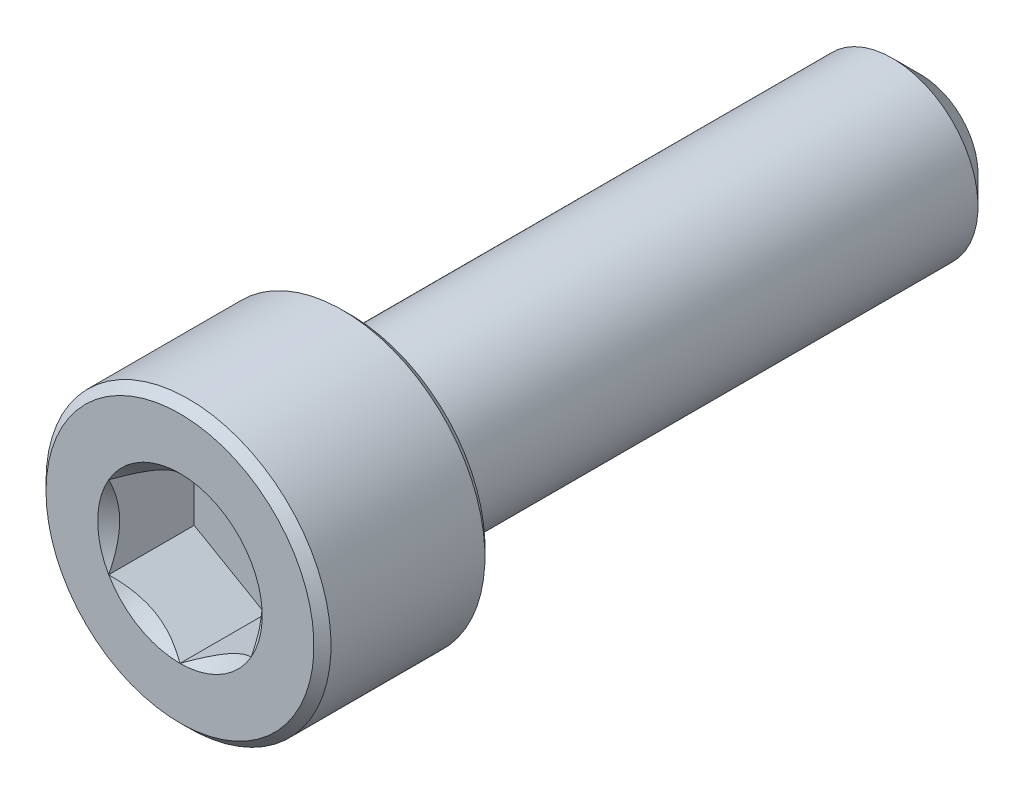
ISO-10303-21;
HEADER;
FILE_DESCRIPTION(('STEP AP214'),'2;1');
FILE_NAME('part.step','',(''),(''),'','','');
FILE_SCHEMA(('AUTOMOTIVE_DESIGN { 1 0 10303 214 1 1 1 1 }'));
ENDSEC;
DATA;
#1=APPLICATION_CONTEXT('core data for automotive mechanical design processes');
#2=APPLICATION_PROTOCOL_DEFINITION('international standard','automotive_design',2000,#1);
#3=PRODUCT_CONTEXT('',#1,'mechanical');
#4=PRODUCT('Part','Part','',(#3));
#5=PRODUCT_RELATED_PRODUCT_CATEGORY('part','',(#4));
#6=PRODUCT_DEFINITION_FORMATION('','',#4);
#7=PRODUCT_DEFINITION_CONTEXT('part definition',#1,'design');
#8=PRODUCT_DEFINITION('design','',#6,#7);
#9=PRODUCT_DEFINITION_SHAPE('','',#8);
#10=(LENGTH_UNIT() NAMED_UNIT(*) SI_UNIT(.MILLI.,.METRE.));
#11=(NAMED_UNIT(*) PLANE_ANGLE_UNIT() SI_UNIT($,.RADIAN.));
#12=(NAMED_UNIT(*) SI_UNIT($,.STERADIAN.) SOLID_ANGLE_UNIT());
#13=UNCERTAINTY_MEASURE_WITH_UNIT(LENGTH_MEASURE(1.E-05),#10,'distance_accuracy_value','');
#14=(GEOMETRIC_REPRESENTATION_CONTEXT(3) GLOBAL_UNCERTAINTY_ASSIGNED_CONTEXT((#13)) GLOBAL_UNIT_ASSIGNED_CONTEXT((#10,
#11,#12)) REPRESENTATION_CONTEXT('',''));
#15=CARTESIAN_POINT('',(0.,0.,0.));
#16=DIRECTION('',(0.,0.,1.));
#17=DIRECTION('',(1.,0.,0.));
#18=AXIS2_PLACEMENT_3D('',#15,#16,#17);
#19=CARTESIAN_POINT('',(0.,4.7,13.));
#20=DIRECTION('',(0.,0.,1.));
#21=DIRECTION('',(1.,0.,0.));
#22=AXIS2_PLACEMENT_3D('',#19,#20,#21);
#23=PLANE('',#22);
#24=CARTESIAN_POINT('',(0.,0.,13.));
#25=DIRECTION('',(0.,0.,1.));
#26=DIRECTION('',(1.,0.,0.));
#27=AXIS2_PLACEMENT_3D('',#24,#25,#26);
#28=CIRCLE('',#27,2.88675134594813);
#29=CARTESIAN_POINT('',(2.5,1.44337567297407,13.));
#30=VERTEX_POINT('',#29);
#31=CARTESIAN_POINT('',(0.,2.88675134594813,13.));
#32=VERTEX_POINT('',#31);
#33=EDGE_CURVE('E92',#30,#32,#28,.T.);
#34=ORIENTED_EDGE('',*,*,#33,.F.);
#35=CARTESIAN_POINT('',(2.5,-1.44337567297407,13.));
#36=VERTEX_POINT('',#35);
#37=EDGE_CURVE('E52',#36,#30,#28,.T.);
#38=ORIENTED_EDGE('',*,*,#37,.F.);
#39=CARTESIAN_POINT('',(0.,-2.88675134594813,13.));
#40=VERTEX_POINT('',#39);
#41=EDGE_CURVE('E278',#40,#36,#28,.T.);
#42=ORIENTED_EDGE('',*,*,#41,.F.);
#43=CARTESIAN_POINT('',(-2.5,-1.44337567297406,13.));
#44=VERTEX_POINT('',#43);
#45=EDGE_CURVE('E59',#44,#40,#28,.T.);
#46=ORIENTED_EDGE('',*,*,#45,.F.);
#47=CARTESIAN_POINT('',(-2.5,1.44337567297407,13.));
#48=VERTEX_POINT('',#47);
#49=EDGE_CURVE('E128',#48,#44,#28,.T.);
#50=ORIENTED_EDGE('',*,*,#49,.F.);
#51=EDGE_CURVE('E101',#32,#48,#28,.T.);
#52=ORIENTED_EDGE('',*,*,#51,.F.);
#53=EDGE_LOOP('',(#34,#38,#42,#46,#50,#52));
#54=FACE_BOUND('',#53,.T.);
#55=CARTESIAN_POINT('',(0.,0.,13.));
#56=DIRECTION('',(0.,0.,-1.));
#57=DIRECTION('',(-1.,0.,0.));
#58=AXIS2_PLACEMENT_3D('',#55,#56,#57);
#59=CIRCLE('',#58,4.7);
#60=CARTESIAN_POINT('',(-4.7,0.,13.));
#61=VERTEX_POINT('',#60);
#62=EDGE_CURVE('E46',#61,#61,#59,.T.);
#63=ORIENTED_EDGE('',*,*,#62,.F.);
#64=EDGE_LOOP('',(#63));
#65=FACE_BOUND('',#64,.T.);
#66=ADVANCED_FACE('F33',(#54,#65),#23,.T.);
#67=CARTESIAN_POINT('',(0.,0.,12.7));
#68=DIRECTION('',(0.,0.,-1.));
#69=DIRECTION('',(-1.,0.,0.));
#70=AXIS2_PLACEMENT_3D('',#67,#68,#69);
#71=CONICAL_SURFACE('',#70,5.,0.785398163397451);
#72=ORIENTED_EDGE('',*,*,#62,.T.);
#73=EDGE_LOOP('',(#72));
#74=FACE_BOUND('',#73,.T.);
#75=CARTESIAN_POINT('',(0.,0.,12.7));
#76=DIRECTION('',(0.,0.,-1.));
#77=DIRECTION('',(-1.,0.,0.));
#78=AXIS2_PLACEMENT_3D('',#75,#76,#77);
#79=CIRCLE('',#78,5.);
#80=CARTESIAN_POINT('',(-5.,0.,12.7));
#81=VERTEX_POINT('',#80);
#82=EDGE_CURVE('E212',#81,#81,#79,.T.);
#83=ORIENTED_EDGE('',*,*,#82,.F.);
#84=EDGE_LOOP('',(#83));
#85=FACE_BOUND('',#84,.T.);
#86=ADVANCED_FACE('F217',(#74,#85),#71,.T.);
#87=CARTESIAN_POINT('',(0.,0.,-13.));
#88=DIRECTION('',(0.,0.,-1.));
#89=DIRECTION('',(-1.,0.,0.));
#90=AXIS2_PLACEMENT_3D('',#87,#88,#89);
#91=CYLINDRICAL_SURFACE('',#90,5.);
#92=ORIENTED_EDGE('',*,*,#82,.T.);
#93=EDGE_LOOP('',(#92));
#94=FACE_BOUND('',#93,.T.);
#95=CARTESIAN_POINT('',(0.,0.,7.3));
#96=DIRECTION('',(0.,0.,-1.));
#97=DIRECTION('',(-1.,0.,0.));
#98=AXIS2_PLACEMENT_3D('',#95,#96,#97);
#99=CIRCLE('',#98,5.);
#100=CARTESIAN_POINT('',(-5.,0.,7.3));
#101=VERTEX_POINT('',#100);
#102=EDGE_CURVE('E209',#101,#101,#99,.T.);
#103=ORIENTED_EDGE('',*,*,#102,.F.);
#104=EDGE_LOOP('',(#103));
#105=FACE_BOUND('',#104,.T.);
#106=ADVANCED_FACE('F223',(#94,#105),#91,.T.);
#107=CARTESIAN_POINT('',(0.,0.,7.));
#108=DIRECTION('',(0.,0.,1.));
#109=DIRECTION('',(1.,0.,0.));
#110=AXIS2_PLACEMENT_3D('',#107,#108,#109);
#111=CONICAL_SURFACE('',#110,4.7,0.78539816339745);
#112=ORIENTED_EDGE('',*,*,#102,.T.);
#113=EDGE_LOOP('',(#112));
#114=FACE_BOUND('',#113,.T.);
#115=CARTESIAN_POINT('',(0.,0.,7.));
#116=DIRECTION('',(0.,0.,-1.));
#117=DIRECTION('',(-1.,0.,0.));
#118=AXIS2_PLACEMENT_3D('',#115,#116,#117);
#119=CIRCLE('',#118,4.7);
#120=CARTESIAN_POINT('',(-4.7,0.,7.));
#121=VERTEX_POINT('',#120);
#122=EDGE_CURVE('E206',#121,#121,#119,.T.);
#123=ORIENTED_EDGE('',*,*,#122,.F.);
#124=EDGE_LOOP('',(#123));
#125=FACE_BOUND('',#124,.T.);
#126=ADVANCED_FACE('F227',(#114,#125),#111,.T.);
#127=CARTESIAN_POINT('',(0.,4.7,7.));
#128=DIRECTION('',(0.,0.,-1.));
#129=DIRECTION('',(-1.,0.,0.));
#130=AXIS2_PLACEMENT_3D('',#127,#128,#129);
#131=PLANE('',#130);
#132=ORIENTED_EDGE('',*,*,#122,.T.);
#133=EDGE_LOOP('',(#132));
#134=FACE_BOUND('',#133,.T.);
#135=CARTESIAN_POINT('',(0.,0.,7.));
#136=DIRECTION('',(0.,0.,-1.));
#137=DIRECTION('',(-1.,0.,0.));
#138=AXIS2_PLACEMENT_3D('',#135,#136,#137);
#139=CIRCLE('',#138,3.);
#140=CARTESIAN_POINT('',(-3.,0.,7.));
#141=VERTEX_POINT('',#140);
#142=EDGE_CURVE('E203',#141,#141,#139,.T.);
#143=ORIENTED_EDGE('',*,*,#142,.F.);
#144=EDGE_LOOP('',(#143));
#145=FACE_BOUND('',#144,.T.);
#146=ADVANCED_FACE('F233',(#134,#145),#131,.T.);
#147=CARTESIAN_POINT('',(0.,0.,-13.));
#148=DIRECTION('',(0.,0.,-1.));
#149=DIRECTION('',(-1.,0.,0.));
#150=AXIS2_PLACEMENT_3D('',#147,#148,#149);
#151=CYLINDRICAL_SURFACE('',#150,3.);
#152=ORIENTED_EDGE('',*,*,#142,.T.);
#153=EDGE_LOOP('',(#152));
#154=FACE_BOUND('',#153,.T.);
#155=CARTESIAN_POINT('',(0.,0.,-12.));
#156=DIRECTION('',(0.,0.,-1.));
#157=DIRECTION('',(-1.,0.,0.));
#158=AXIS2_PLACEMENT_3D('',#155,#156,#157);
#159=CIRCLE('',#158,3.);
#160=CARTESIAN_POINT('',(-3.,0.,-12.));
#161=VERTEX_POINT('',#160);
#162=EDGE_CURVE('E200',#161,#161,#159,.T.);
#163=ORIENTED_EDGE('',*,*,#162,.F.);
#164=EDGE_LOOP('',(#163));
#165=FACE_BOUND('',#164,.T.);
#166=ADVANCED_FACE('F237',(#154,#165),#151,.T.);
#167=CARTESIAN_POINT('',(0.,0.,-13.));
#168=DIRECTION('',(0.,0.,1.));
#169=DIRECTION('',(1.,0.,0.));
#170=AXIS2_PLACEMENT_3D('',#167,#168,#169);
#171=CONICAL_SURFACE('',#170,2.,0.785398163397444);
#172=ORIENTED_EDGE('',*,*,#162,.T.);
#173=EDGE_LOOP('',(#172));
#174=FACE_BOUND('',#173,.T.);
#175=CARTESIAN_POINT('',(0.,0.,-13.));
#176=DIRECTION('',(0.,0.,-1.));
#177=DIRECTION('',(-1.,0.,0.));
#178=AXIS2_PLACEMENT_3D('',#175,#176,#177);
#179=CIRCLE('',#178,2.);
#180=CARTESIAN_POINT('',(-2.,0.,-13.));
#181=VERTEX_POINT('',#180);
#182=EDGE_CURVE('E188',#181,#181,#179,.T.);
#183=ORIENTED_EDGE('',*,*,#182,.F.);
#184=EDGE_LOOP('',(#183));
#185=FACE_BOUND('',#184,.T.);
#186=ADVANCED_FACE('F240',(#174,#185),#171,.T.);
#187=CARTESIAN_POINT('',(0.,2.,-13.));
#188=DIRECTION('',(0.,0.,-1.));
#189=DIRECTION('',(-1.,0.,0.));
#190=AXIS2_PLACEMENT_3D('',#187,#188,#189);
#191=PLANE('',#190);
#192=ORIENTED_EDGE('',*,*,#182,.T.);
#193=EDGE_LOOP('',(#192));
#194=FACE_BOUND('',#193,.T.);
#195=ADVANCED_FACE('F161',(#194),#191,.T.);
#196=CARTESIAN_POINT('',(0.,0.,13.));
#197=DIRECTION('',(0.,0.,1.));
#198=DIRECTION('',(1.,0.,0.));
#199=AXIS2_PLACEMENT_3D('',#196,#197,#198);
#200=CONICAL_SURFACE('',#199,2.88675134594813,0.78539816339745);
#201=ORIENTED_EDGE('',*,*,#51,.T.);
#202=CARTESIAN_POINT('',(0.00020000000000054,2.88686681600197,13.0001154769818));
#203=CARTESIAN_POINT('',(-0.0857382777877643,2.83725032818751,12.9505407053547));
#204=CARTESIAN_POINT('',(-0.173113567275753,2.7868041812811,12.9038774813625));
#205=CARTESIAN_POINT('',(-0.351281456165588,2.6839389026696,12.8184381400383));
#206=CARTESIAN_POINT('',(-0.442091000681074,2.6315099876986,12.779709562406));
#207=CARTESIAN_POINT('',(-0.625204123126921,2.52578957716234,12.7133667038977));
#208=CARTESIAN_POINT('',(-0.71746106452934,2.47252500720904,12.6855856685309));
#209=CARTESIAN_POINT('',(-0.904006008776286,2.3648232334321,12.6427831759107));
#210=CARTESIAN_POINT('',(-0.998288312566283,2.31038931995913,12.6277297666713));
#211=CARTESIAN_POINT('',(-1.16077825829185,2.21657570605387,12.6141477222095));
#212=CARTESIAN_POINT('',(-1.22877596788015,2.17731721011878,12.6121370992408));
#213=CARTESIAN_POINT('',(-1.36466024116922,2.0988643883567,12.6155241171875));
#214=CARTESIAN_POINT('',(-1.43254675755224,2.05967008984862,12.6209243552998));
#215=CARTESIAN_POINT('',(-1.56767878823611,1.98165157555715,12.6388257884025));
#216=CARTESIAN_POINT('',(-1.63492349975356,1.94282782326097,12.6513349270465));
#217=CARTESIAN_POINT('',(-1.7682501008182,1.86585167424616,12.6827675019557));
#218=CARTESIAN_POINT('',(-1.83433207909966,1.82769922629678,12.7016904464968));
#219=CARTESIAN_POINT('',(-2.00359634669126,1.72997445583858,12.7578673614082));
#220=CARTESIAN_POINT('',(-2.10572912222289,1.67100807039231,12.7993558315962));
#221=CARTESIAN_POINT('',(-2.25590641494051,1.58430317001562,12.8693940467231));
#222=CARTESIAN_POINT('',(-2.30539653988261,1.55573003305807,12.8940022521161));
#223=CARTESIAN_POINT('',(-2.40346006383885,1.49911303110426,12.9454618867152));
#224=CARTESIAN_POINT('',(-2.45203400349693,1.47106885396706,12.9723119387794));
#225=CARTESIAN_POINT('',(-2.5002,1.44326020292023,13.0001154769818));
#226=B_SPLINE_CURVE_WITH_KNOTS('',3,(#202,#203,#204,#205,#206,#207,#208,#209,#210,#211,#212,
#213,#214,#215,#216,#217,#218,#219,#220,#221,#222,#223,#224,#225),.UNSPECIFIED.,.F.,.F.,(4,2,2,
2,2,2,2,2,2,2,2,4),(0.,0.333012085133924,0.667964518301397,0.997597032043299,1.32639954393844,
1.56169424147169,1.79707142102083,2.03271213522171,2.26833478775651,2.64260240809533,
2.82922877818864,3.01574133749025),.UNSPECIFIED.);
#227=EDGE_CURVE('E11',#32,#48,#226,.T.);
#228=ORIENTED_EDGE('',*,*,#227,.F.);
#229=EDGE_LOOP('',(#201,#228));
#230=FACE_BOUND('',#229,.T.);
#231=ADVANCED_FACE('F105',(#230),#200,.F.);
#232=ORIENTED_EDGE('',*,*,#49,.T.);
#233=CARTESIAN_POINT('',(-2.5,-2.96668433955212,13.9928383192799));
#234=CARTESIAN_POINT('',(-2.5,-2.89483170967249,13.9379057089797));
#235=CARTESIAN_POINT('',(-2.5,-2.82258679707705,13.883478050823));
#236=CARTESIAN_POINT('',(-2.5,-2.67715393829105,13.7758617915343));
#237=CARTESIAN_POINT('',(-2.5,-2.60396576868743,13.7226734926472));
#238=CARTESIAN_POINT('',(-2.5,-2.45595268046653,13.6173865397426));
#239=CARTESIAN_POINT('',(-2.5,-2.38111948346966,13.5652994850005));
#240=CARTESIAN_POINT('',(-2.5,-2.23019896534479,13.4629812536341));
#241=CARTESIAN_POINT('',(-2.5,-2.15411173180743,13.4127499481792));
#242=CARTESIAN_POINT('',(-2.5,-1.99575761371829,13.311547152196));
#243=CARTESIAN_POINT('',(-2.5,-1.91339821044007,13.2607196975498));
#244=CARTESIAN_POINT('',(-2.5,-1.74677292530007,13.1622970160088));
#245=CARTESIAN_POINT('',(-2.5,-1.6625072948511,13.1147013661458));
#246=CARTESIAN_POINT('',(-2.5,-1.49202090628761,13.0237370895292));
#247=CARTESIAN_POINT('',(-2.5,-1.4058065139511,12.9803566253319));
#248=CARTESIAN_POINT('',(-2.5,-1.23096887512707,12.8988023964179));
#249=CARTESIAN_POINT('',(-2.5,-1.14234677306193,12.8606262082116));
#250=CARTESIAN_POINT('',(-2.5,-0.970857842618474,12.7940912240297));
#251=CARTESIAN_POINT('',(-2.5,-0.88821917035142,12.7651503854592));
#252=CARTESIAN_POINT('',(-2.5,-0.720875298126569,12.7138877367376));
#253=CARTESIAN_POINT('',(-2.5,-0.636169963529764,12.6915663590842));
#254=CARTESIAN_POINT('',(-2.5,-0.466650942448522,12.6551078210399));
#255=CARTESIAN_POINT('',(-2.5,-0.381869134653474,12.640824902214));
#256=CARTESIAN_POINT('',(-2.5,-0.21130174226405,12.6207346384147));
#257=CARTESIAN_POINT('',(-2.5,-0.125516356521813,12.6149256421311));
#258=CARTESIAN_POINT('',(-2.5,0.0426703656744087,12.6122567453414));
#259=CARTESIAN_POINT('',(-2.5,0.125066107632579,12.6150393831091));
#260=CARTESIAN_POINT('',(-2.5,0.289193381610074,12.6285896677016));
#261=CARTESIAN_POINT('',(-2.5,0.370924851074764,12.6393580579361));
#262=CARTESIAN_POINT('',(-2.5,0.534518605306861,12.668460488394));
#263=CARTESIAN_POINT('',(-2.5,0.616357066153054,12.6869264467587));
#264=CARTESIAN_POINT('',(-2.5,0.778230408567296,12.7304160931401));
#265=CARTESIAN_POINT('',(-2.5,0.85826540901519,12.7554393475341));
#266=CARTESIAN_POINT('',(-2.5,1.1064014205137,12.8425323271403));
#267=CARTESIAN_POINT('',(-2.5,1.27108970475709,12.9143583169891));
#268=CARTESIAN_POINT('',(-2.5,1.51211013995078,13.0341428940312));
#269=CARTESIAN_POINT('',(-2.5,1.59159684007468,13.0761721404265));
#270=CARTESIAN_POINT('',(-2.5,1.74876895904321,13.1634810506814));
#271=CARTESIAN_POINT('',(-2.5,1.82645469386738,13.2087601385578));
#272=CARTESIAN_POINT('',(-2.5,1.97643122124165,13.2996104452916));
#273=CARTESIAN_POINT('',(-2.5,2.04879877304287,13.3450563815238));
#274=CARTESIAN_POINT('',(-2.5,2.19229239644038,13.4378770245958));
#275=CARTESIAN_POINT('',(-2.5,2.2634183740633,13.4852518765365));
#276=CARTESIAN_POINT('',(-2.5,2.4040160675888,13.5811974908952));
#277=CARTESIAN_POINT('',(-2.5,2.473496495387,13.6297555399303));
#278=CARTESIAN_POINT('',(-2.5,2.61150521882323,13.7281681623755));
#279=CARTESIAN_POINT('',(-2.5,2.68003377150943,13.7780223748942));
#280=CARTESIAN_POINT('',(-2.5,2.74816343524431,13.8284070984273));
#281=B_SPLINE_CURVE_WITH_KNOTS('',3,(#233,#234,#235,#236,#237,#238,#239,#240,#241,#242,#243,
#244,#245,#246,#247,#248,#249,#250,#251,#252,#253,#254,#255,#256,#257,#258,#259,#260,#261,#262,
#263,#264,#265,#266,#267,#268,#269,#270,#271,#272,#273,#274,#275,#276,#277,#278,#279,#280),
.UNSPECIFIED.,.F.,.F.,(4,2,2,2,2,2,2,2,2,2,2,2,2,2,2,2,2,2,2,2,2,2,2,4),(0.,0.271341667855833,
0.542748830046722,0.816253709161615,1.08973956507594,1.38002315639178,1.67026868280412,
1.959674013636,2.24894411253435,2.51139576932094,2.77386457021756,3.0314066607157,
3.28889855737335,3.53582375183444,3.78277193594475,4.03413854269895,4.28548853120069,
4.82282938730674,5.09254998785807,5.36222290216636,5.61855395261544,5.87490432107988,
6.12918893681205,6.38340349453406),.UNSPECIFIED.);
#282=EDGE_CURVE('E100',#48,#44,#281,.F.);
#283=ORIENTED_EDGE('',*,*,#282,.F.);
#284=EDGE_LOOP('',(#232,#283));
#285=FACE_BOUND('',#284,.T.);
#286=ADVANCED_FACE('F255',(#285),#200,.F.);
#287=ORIENTED_EDGE('',*,*,#45,.T.);
#288=CARTESIAN_POINT('',(-2.5002,-1.44326020292023,13.0001154769818));
#289=CARTESIAN_POINT('',(-2.41426172221224,-1.49287669073469,12.9505407053547));
#290=CARTESIAN_POINT('',(-2.32688643272425,-1.5433228376411,12.9038774813625));
#291=CARTESIAN_POINT('',(-2.14871854383441,-1.64618811625259,12.8184381400383));
#292=CARTESIAN_POINT('',(-2.05790899931893,-1.69861703122359,12.779709562406));
#293=CARTESIAN_POINT('',(-1.87479587687308,-1.80433744175986,12.7133667038977));
#294=CARTESIAN_POINT('',(-1.78253893547066,-1.85760201171315,12.6855856685309));
#295=CARTESIAN_POINT('',(-1.59599399122372,-1.96530378549009,12.6427831759107));
#296=CARTESIAN_POINT('',(-1.50171168743372,-2.01973769896306,12.6277297666713));
#297=CARTESIAN_POINT('',(-1.33922174170816,-2.11355131286833,12.6141477222095));
#298=CARTESIAN_POINT('',(-1.27122403211985,-2.15280980880341,12.6121370992408));
#299=CARTESIAN_POINT('',(-1.13533975883078,-2.23126263056549,12.6155241171875));
#300=CARTESIAN_POINT('',(-1.06745324244776,-2.27045692907357,12.6209243552998));
#301=CARTESIAN_POINT('',(-0.932321211763896,-2.34847544336505,12.6388257884025));
#302=CARTESIAN_POINT('',(-0.865076500246441,-2.38729919566123,12.6513349270465));
#303=CARTESIAN_POINT('',(-0.731749899181803,-2.46427534467604,12.6827675019557));
#304=CARTESIAN_POINT('',(-0.665667920900345,-2.50242779262542,12.7016904464968));
#305=CARTESIAN_POINT('',(-0.496403653308737,-2.60015256308362,12.7578673614082));
#306=CARTESIAN_POINT('',(-0.394270877777109,-2.65911894852989,12.7993558315962));
#307=CARTESIAN_POINT('',(-0.244093585059492,-2.74582384890657,12.8693940467231));
#308=CARTESIAN_POINT('',(-0.194603460117392,-2.77439698586412,12.8940022521161));
#309=CARTESIAN_POINT('',(-0.096539936161154,-2.83101398781794,12.9454618867152));
#310=CARTESIAN_POINT('',(-0.0479659965030727,-2.85905816495513,12.9723119387794));
#311=CARTESIAN_POINT('',(0.000199999999999383,-2.88686681600197,13.0001154769818));
#312=B_SPLINE_CURVE_WITH_KNOTS('',3,(#288,#289,#290,#291,#292,#293,#294,#295,#296,#297,#298,
#299,#300,#301,#302,#303,#304,#305,#306,#307,#308,#309,#310,#311),.UNSPECIFIED.,.F.,.F.,(4,2,2,
2,2,2,2,2,2,2,2,4),(0.,0.333012085133924,0.667964518301397,0.997597032043299,1.32639954393844,
1.56169424147169,1.79707142102083,2.03271213522171,2.26833478775651,2.64260240809533,
2.82922877818864,3.01574133749025),.UNSPECIFIED.);
#313=EDGE_CURVE('E137',#44,#40,#312,.T.);
#314=ORIENTED_EDGE('',*,*,#313,.F.);
#315=EDGE_LOOP('',(#287,#314));
#316=FACE_BOUND('',#315,.T.);
#317=ADVANCED_FACE('F259',(#316),#200,.F.);
#318=ORIENTED_EDGE('',*,*,#41,.T.);
#319=CARTESIAN_POINT('',(-0.000200000000000439,-2.88686681600197,13.0001154769818));
#320=CARTESIAN_POINT('',(0.0857382777877646,-2.83725032818751,12.9505407053547));
#321=CARTESIAN_POINT('',(0.173113567275753,-2.7868041812811,12.9038774813625));
#322=CARTESIAN_POINT('',(0.351281456165588,-2.6839389026696,12.8184381400383));
#323=CARTESIAN_POINT('',(0.442091000681074,-2.6315099876986,12.779709562406));
#324=CARTESIAN_POINT('',(0.62520412312692,-2.52578957716234,12.7133667038977));
#325=CARTESIAN_POINT('',(0.717461064529339,-2.47252500720904,12.6855856685309));
#326=CARTESIAN_POINT('',(0.904006008776285,-2.3648232334321,12.6427831759107));
#327=CARTESIAN_POINT('',(0.998288312566282,-2.31038931995913,12.6277297666713));
#328=CARTESIAN_POINT('',(1.16077825829184,-2.21657570605387,12.6141477222095));
#329=CARTESIAN_POINT('',(1.22877596788015,-2.17731721011878,12.6121370992408));
#330=CARTESIAN_POINT('',(1.36466024116922,-2.0988643883567,12.6155241171875));
#331=CARTESIAN_POINT('',(1.43254675755224,-2.05967008984862,12.6209243552998));
#332=CARTESIAN_POINT('',(1.5676787882361,-1.98165157555715,12.6388257884025));
#333=CARTESIAN_POINT('',(1.63492349975356,-1.94282782326097,12.6513349270465));
#334=CARTESIAN_POINT('',(1.7682501008182,-1.86585167424616,12.6827675019557));
#335=CARTESIAN_POINT('',(1.83433207909966,-1.82769922629678,12.7016904464968));
#336=CARTESIAN_POINT('',(2.00359634669126,-1.72997445583858,12.7578673614082));
#337=CARTESIAN_POINT('',(2.10572912222289,-1.67100807039231,12.7993558315962));
#338=CARTESIAN_POINT('',(2.25590641494051,-1.58430317001562,12.8693940467231));
#339=CARTESIAN_POINT('',(2.30539653988261,-1.55573003305807,12.8940022521161));
#340=CARTESIAN_POINT('',(2.40346006383885,-1.49911303110426,12.9454618867152));
#341=CARTESIAN_POINT('',(2.45203400349693,-1.47106885396706,12.9723119387794));
#342=CARTESIAN_POINT('',(2.5002,-1.44326020292023,13.0001154769818));
#343=B_SPLINE_CURVE_WITH_KNOTS('',3,(#319,#320,#321,#322,#323,#324,#325,#326,#327,#328,#329,
#330,#331,#332,#333,#334,#335,#336,#337,#338,#339,#340,#341,#342),.UNSPECIFIED.,.F.,.F.,(4,2,2,
2,2,2,2,2,2,2,2,4),(0.,0.333012085133923,0.667964518301395,0.997597032043297,1.32639954393844,
1.56169424147168,1.79707142102083,2.0327121352217,2.2683347877565,2.64260240809533,
2.82922877818864,3.01574133749025),.UNSPECIFIED.);
#344=EDGE_CURVE('E280',#40,#36,#343,.T.);
#345=ORIENTED_EDGE('',*,*,#344,.F.);
#346=EDGE_LOOP('',(#318,#345));
#347=FACE_BOUND('',#346,.T.);
#348=ADVANCED_FACE('F268',(#347),#200,.F.);
#349=ORIENTED_EDGE('',*,*,#37,.T.);
#350=CARTESIAN_POINT('',(2.5,-2.96668433956992,13.9928383192935));
#351=CARTESIAN_POINT('',(2.5,-2.89483170968978,13.9379057089928));
#352=CARTESIAN_POINT('',(2.5,-2.82258679709383,13.8834780508356));
#353=CARTESIAN_POINT('',(2.5,-2.6771539383068,13.7758617915458));
#354=CARTESIAN_POINT('',(2.5,-2.60396576870267,13.7226734926582));
#355=CARTESIAN_POINT('',(2.5,-2.45595268048071,13.6173865397526));
#356=CARTESIAN_POINT('',(2.5,-2.38111948348332,13.5652994850099));
#357=CARTESIAN_POINT('',(2.5,-2.23019896535737,13.4629812536425));
#358=CARTESIAN_POINT('',(2.5,-2.15411173181947,13.4127499481871));
#359=CARTESIAN_POINT('',(2.5,-1.99575761372916,13.3115471522028));
#360=CARTESIAN_POINT('',(2.5,-1.91339821045031,13.260719697556));
#361=CARTESIAN_POINT('',(2.5,-1.74677292530902,13.1622970160139));
#362=CARTESIAN_POINT('',(2.5,-1.6625072948594,13.1147013661504));
#363=CARTESIAN_POINT('',(2.5,-1.49202090629459,13.0237370895328));
#364=CARTESIAN_POINT('',(2.5,-1.4058065139574,12.980356625335));
#365=CARTESIAN_POINT('',(2.5,-1.23096887513198,12.8988023964201));
#366=CARTESIAN_POINT('',(2.5,-1.14234677306614,12.8606262082134));
#367=CARTESIAN_POINT('',(2.5,-0.970857842622378,12.7940912240311));
#368=CARTESIAN_POINT('',(2.5,-0.888219170355766,12.7651503854607));
#369=CARTESIAN_POINT('',(2.5,-0.720875298131817,12.713887736739));
#370=CARTESIAN_POINT('',(2.5,-0.636169963535471,12.6915663590856));
#371=CARTESIAN_POINT('',(2.5,-0.466650942455131,12.6551078210411));
#372=CARTESIAN_POINT('',(2.5,-0.381869134660527,12.6408249022151));
#373=CARTESIAN_POINT('',(2.5,-0.211301742271978,12.6207346384154));
#374=CARTESIAN_POINT('',(2.5,-0.125516356530172,12.6149256421315));
#375=CARTESIAN_POINT('',(2.5,0.0426703656652955,12.6122567453413));
#376=CARTESIAN_POINT('',(2.5,0.125066107623141,12.6150393831087));
#377=CARTESIAN_POINT('',(2.5,0.289193381600021,12.6285896677004));
#378=CARTESIAN_POINT('',(2.5,0.370924851064421,12.6393580579346));
#379=CARTESIAN_POINT('',(2.5,0.534518605295947,12.6684604883917));
#380=CARTESIAN_POINT('',(2.5,0.616357066141858,12.686926446756));
#381=CARTESIAN_POINT('',(2.5,0.778230408555567,12.7304160931367));
#382=CARTESIAN_POINT('',(2.5,0.858265409003208,12.7554393475302));
#383=CARTESIAN_POINT('',(2.5,1.10640142049915,12.8425323271345));
#384=CARTESIAN_POINT('',(2.5,1.27108970474035,12.9143583169815));
#385=CARTESIAN_POINT('',(2.5,1.51211013993089,13.034142894021));
#386=CARTESIAN_POINT('',(2.5,1.59159684005377,13.0761721404153));
#387=CARTESIAN_POINT('',(2.5,1.74876895902027,13.1634810506683));
#388=CARTESIAN_POINT('',(2.5,1.82645469384344,13.2087601385437));
#389=CARTESIAN_POINT('',(2.5,1.97643122121589,13.2996104452756));
#390=CARTESIAN_POINT('',(2.5,2.0487987730163,13.345056381507));
#391=CARTESIAN_POINT('',(2.5,2.19229239641219,13.4378770245772));
#392=CARTESIAN_POINT('',(2.5,2.26341837403431,13.485251876517));
#393=CARTESIAN_POINT('',(2.5,2.40401606755821,13.581197490874));
#394=CARTESIAN_POINT('',(2.5,2.47349649535563,13.6297555399082));
#395=CARTESIAN_POINT('',(2.5,2.61150521879029,13.7281681623517));
#396=CARTESIAN_POINT('',(2.5,2.68003377147571,13.7780223748695));
#397=CARTESIAN_POINT('',(2.5,2.74816343520981,13.8284070984017));
#398=B_SPLINE_CURVE_WITH_KNOTS('',3,(#350,#351,#352,#353,#354,#355,#356,#357,#358,#359,#360,
#361,#362,#363,#364,#365,#366,#367,#368,#369,#370,#371,#372,#373,#374,#375,#376,#377,#378,#379,
#380,#381,#382,#383,#384,#385,#386,#387,#388,#389,#390,#391,#392,#393,#394,#395,#396,#397),
.UNSPECIFIED.,.F.,.F.,(4,2,2,2,2,2,2,2,2,2,2,2,2,2,2,2,2,2,2,2,2,2,2,4),(0.,0.271341667858004,
0.542748830051066,0.81625370916817,1.08973956508471,1.38002315640303,1.67026868281787,
1.95967401365221,2.24894411255303,2.51139576933832,2.77386457023366,3.03140666073056,
3.28889855738698,3.53582375184707,3.78277193595638,4.03413854270949,4.28548853121014,
4.82282938730813,5.0925499878554,5.36222290215963,5.61855395260524,5.87490432106621,
6.12918893679497,6.38340349451356),.UNSPECIFIED.);
#399=EDGE_CURVE('E117',#36,#30,#398,.T.);
#400=ORIENTED_EDGE('',*,*,#399,.F.);
#401=EDGE_LOOP('',(#349,#400));
#402=FACE_BOUND('',#401,.T.);
#403=ADVANCED_FACE('F262',(#402),#200,.F.);
#404=ORIENTED_EDGE('',*,*,#33,.T.);
#405=CARTESIAN_POINT('',(2.5002,1.44326020292023,13.0001154769818));
#406=CARTESIAN_POINT('',(2.41426172221224,1.49287669073469,12.9505407053547));
#407=CARTESIAN_POINT('',(2.32688643272425,1.5433228376411,12.9038774813625));
#408=CARTESIAN_POINT('',(2.14871854383441,1.64618811625259,12.8184381400383));
#409=CARTESIAN_POINT('',(2.05790899931893,1.6986170312236,12.779709562406));
#410=CARTESIAN_POINT('',(1.87479587687308,1.80433744175986,12.7133667038977));
#411=CARTESIAN_POINT('',(1.78253893547066,1.85760201171316,12.6855856685309));
#412=CARTESIAN_POINT('',(1.59599399122372,1.96530378549009,12.6427831759107));
#413=CARTESIAN_POINT('',(1.50171168743372,2.01973769896307,12.6277297666713));
#414=CARTESIAN_POINT('',(1.33922174170816,2.11355131286833,12.6141477222095));
#415=CARTESIAN_POINT('',(1.27122403211985,2.15280980880341,12.6121370992408));
#416=CARTESIAN_POINT('',(1.13533975883078,2.23126263056549,12.6155241171875));
#417=CARTESIAN_POINT('',(1.06745324244776,2.27045692907358,12.6209243552998));
#418=CARTESIAN_POINT('',(0.932321211763896,2.34847544336505,12.6388257884025));
#419=CARTESIAN_POINT('',(0.865076500246441,2.38729919566123,12.6513349270465));
#420=CARTESIAN_POINT('',(0.731749899181802,2.46427534467604,12.6827675019557));
#421=CARTESIAN_POINT('',(0.665667920900344,2.50242779262542,12.7016904464968));
#422=CARTESIAN_POINT('',(0.496403653308737,2.60015256308362,12.7578673614083));
#423=CARTESIAN_POINT('',(0.394270877777109,2.65911894852989,12.7993558315962));
#424=CARTESIAN_POINT('',(0.244093585059493,2.74582384890657,12.8693940467231));
#425=CARTESIAN_POINT('',(0.194603460117392,2.77439698586412,12.8940022521161));
#426=CARTESIAN_POINT('',(0.096539936161154,2.83101398781794,12.9454618867152));
#427=CARTESIAN_POINT('',(0.0479659965030727,2.85905816495513,12.9723119387794));
#428=CARTESIAN_POINT('',(-0.000199999999999507,2.88686681600197,13.0001154769818));
#429=B_SPLINE_CURVE_WITH_KNOTS('',3,(#405,#406,#407,#408,#409,#410,#411,#412,#413,#414,#415,
#416,#417,#418,#419,#420,#421,#422,#423,#424,#425,#426,#427,#428),.UNSPECIFIED.,.F.,.F.,(4,2,2,
2,2,2,2,2,2,2,2,4),(0.,0.333012085133925,0.667964518301398,0.997597032043299,1.32639954393844,
1.56169424147169,1.79707142102083,2.03271213522171,2.26833478775651,2.64260240809533,
2.82922877818864,3.01574133749025),.UNSPECIFIED.);
#430=EDGE_CURVE('E96',#30,#32,#429,.T.);
#431=ORIENTED_EDGE('',*,*,#430,.F.);
#432=EDGE_LOOP('',(#404,#431));
#433=FACE_BOUND('',#432,.T.);
#434=ADVANCED_FACE('F94',(#433),#200,.F.);
#435=CARTESIAN_POINT('',(0.,0.,10.));
#436=DIRECTION('',(0.,0.,1.));
#437=DIRECTION('',(1.,0.,0.));
#438=AXIS2_PLACEMENT_3D('',#435,#436,#437);
#439=PLANE('',#438);
#440=DIRECTION('',(-0.866025403784439,0.5,0.));
#441=VECTOR('',#440,1.);
#442=CARTESIAN_POINT('',(2.5,1.44337567297407,10.));
#443=LINE('',#442,#441);
#444=CARTESIAN_POINT('',(2.5,1.44337567297407,10.));
#445=VERTEX_POINT('',#444);
#446=CARTESIAN_POINT('',(0.,2.88675134594813,10.));
#447=VERTEX_POINT('',#446);
#448=EDGE_CURVE('E116',#445,#447,#443,.T.);
#449=ORIENTED_EDGE('',*,*,#448,.T.);
#450=DIRECTION('',(-0.866025403784439,-0.5,0.));
#451=VECTOR('',#450,1.);
#452=CARTESIAN_POINT('',(0.,2.88675134594813,10.));
#453=LINE('',#452,#451);
#454=CARTESIAN_POINT('',(-2.5,1.44337567297407,10.));
#455=VERTEX_POINT('',#454);
#456=EDGE_CURVE('E121',#447,#455,#453,.T.);
#457=ORIENTED_EDGE('',*,*,#456,.T.);
#458=DIRECTION('',(0.,-1.,0.));
#459=VECTOR('',#458,1.);
#460=CARTESIAN_POINT('',(-2.5,1.44337567297407,10.));
#461=LINE('',#460,#459);
#462=CARTESIAN_POINT('',(-2.5,-1.44337567297406,10.));
#463=VERTEX_POINT('',#462);
#464=EDGE_CURVE('E176',#455,#463,#461,.T.);
#465=ORIENTED_EDGE('',*,*,#464,.T.);
#466=DIRECTION('',(0.866025403784439,-0.5,0.));
#467=VECTOR('',#466,1.);
#468=CARTESIAN_POINT('',(-2.5,-1.44337567297406,10.));
#469=LINE('',#468,#467);
#470=CARTESIAN_POINT('',(0.,-2.88675134594813,10.));
#471=VERTEX_POINT('',#470);
#472=EDGE_CURVE('E179',#463,#471,#469,.T.);
#473=ORIENTED_EDGE('',*,*,#472,.T.);
#474=DIRECTION('',(0.866025403784439,0.5,0.));
#475=VECTOR('',#474,1.);
#476=CARTESIAN_POINT('',(0.,-2.88675134594813,10.));
#477=LINE('',#476,#475);
#478=CARTESIAN_POINT('',(2.5,-1.44337567297407,10.));
#479=VERTEX_POINT('',#478);
#480=EDGE_CURVE('E182',#471,#479,#477,.T.);
#481=ORIENTED_EDGE('',*,*,#480,.T.);
#482=DIRECTION('',(0.,1.,0.));
#483=VECTOR('',#482,1.);
#484=CARTESIAN_POINT('',(2.5,-1.44337567297407,10.));
#485=LINE('',#484,#483);
#486=EDGE_CURVE('E124',#479,#445,#485,.T.);
#487=ORIENTED_EDGE('',*,*,#486,.T.);
#488=EDGE_LOOP('',(#449,#457,#465,#473,#481,#487));
#489=FACE_BOUND('',#488,.T.);
#490=ADVANCED_FACE('F156',(#489),#439,.T.);
#491=CARTESIAN_POINT('',(0.,2.88675134594813,10.));
#492=DIRECTION('',(-0.5,0.866025403784439,0.));
#493=DIRECTION('',(-0.866025403784439,-0.5,0.));
#494=AXIS2_PLACEMENT_3D('',#491,#492,#493);
#495=PLANE('',#494);
#496=DIRECTION('',(0.,0.,1.));
#497=VECTOR('',#496,1.);
#498=CARTESIAN_POINT('',(0.,2.88675134594813,10.));
#499=LINE('',#498,#497);
#500=EDGE_CURVE('E113',#447,#32,#499,.T.);
#501=ORIENTED_EDGE('',*,*,#500,.T.);
#502=ORIENTED_EDGE('',*,*,#227,.T.);
#503=DIRECTION('',(0.,0.,1.));
#504=VECTOR('',#503,1.);
#505=CARTESIAN_POINT('',(-2.5,1.44337567297407,10.));
#506=LINE('',#505,#504);
#507=EDGE_CURVE('E123',#455,#48,#506,.T.);
#508=ORIENTED_EDGE('',*,*,#507,.F.);
#509=ORIENTED_EDGE('',*,*,#456,.F.);
#510=EDGE_LOOP('',(#501,#502,#508,#509));
#511=FACE_BOUND('',#510,.T.);
#512=ADVANCED_FACE('F119',(#511),#495,.F.);
#513=CARTESIAN_POINT('',(-2.5,1.44337567297407,10.));
#514=DIRECTION('',(-1.,0.,0.));
#515=DIRECTION('',(0.,0.,1.));
#516=AXIS2_PLACEMENT_3D('',#513,#514,#515);
#517=PLANE('',#516);
#518=ORIENTED_EDGE('',*,*,#507,.T.);
#519=ORIENTED_EDGE('',*,*,#282,.T.);
#520=DIRECTION('',(0.,0.,1.));
#521=VECTOR('',#520,1.);
#522=CARTESIAN_POINT('',(-2.5,-1.44337567297406,10.));
#523=LINE('',#522,#521);
#524=EDGE_CURVE('E194',#463,#44,#523,.T.);
#525=ORIENTED_EDGE('',*,*,#524,.F.);
#526=ORIENTED_EDGE('',*,*,#464,.F.);
#527=EDGE_LOOP('',(#518,#519,#525,#526));
#528=FACE_BOUND('',#527,.T.);
#529=ADVANCED_FACE('F146',(#528),#517,.F.);
#530=CARTESIAN_POINT('',(-2.5,-1.44337567297406,10.));
#531=DIRECTION('',(-0.5,-0.866025403784439,0.));
#532=DIRECTION('',(0.866025403784439,-0.5,0.));
#533=AXIS2_PLACEMENT_3D('',#530,#531,#532);
#534=PLANE('',#533);
#535=ORIENTED_EDGE('',*,*,#524,.T.);
#536=ORIENTED_EDGE('',*,*,#313,.T.);
#537=DIRECTION('',(0.,0.,1.));
#538=VECTOR('',#537,1.);
#539=CARTESIAN_POINT('',(0.,-2.88675134594813,10.));
#540=LINE('',#539,#538);
#541=EDGE_CURVE('E191',#471,#40,#540,.T.);
#542=ORIENTED_EDGE('',*,*,#541,.F.);
#543=ORIENTED_EDGE('',*,*,#472,.F.);
#544=EDGE_LOOP('',(#535,#536,#542,#543));
#545=FACE_BOUND('',#544,.T.);
#546=ADVANCED_FACE('F149',(#545),#534,.F.);
#547=CARTESIAN_POINT('',(0.,-2.88675134594813,10.));
#548=DIRECTION('',(0.5,-0.866025403784439,0.));
#549=DIRECTION('',(0.866025403784439,0.5,0.));
#550=AXIS2_PLACEMENT_3D('',#547,#548,#549);
#551=PLANE('',#550);
#552=ORIENTED_EDGE('',*,*,#541,.T.);
#553=ORIENTED_EDGE('',*,*,#344,.T.);
#554=DIRECTION('',(0.,0.,1.));
#555=VECTOR('',#554,1.);
#556=CARTESIAN_POINT('',(2.5,-1.44337567297407,10.));
#557=LINE('',#556,#555);
#558=EDGE_CURVE('E189',#479,#36,#557,.T.);
#559=ORIENTED_EDGE('',*,*,#558,.F.);
#560=ORIENTED_EDGE('',*,*,#480,.F.);
#561=EDGE_LOOP('',(#552,#553,#559,#560));
#562=FACE_BOUND('',#561,.T.);
#563=ADVANCED_FACE('F286',(#562),#551,.F.);
#564=CARTESIAN_POINT('',(2.5,-1.44337567297407,10.));
#565=DIRECTION('',(1.,0.,0.));
#566=DIRECTION('',(0.,1.,0.));
#567=AXIS2_PLACEMENT_3D('',#564,#565,#566);
#568=PLANE('',#567);
#569=ORIENTED_EDGE('',*,*,#558,.T.);
#570=ORIENTED_EDGE('',*,*,#399,.T.);
#571=DIRECTION('',(0.,0.,1.));
#572=VECTOR('',#571,1.);
#573=CARTESIAN_POINT('',(2.5,1.44337567297407,10.));
#574=LINE('',#573,#572);
#575=EDGE_CURVE('E115',#445,#30,#574,.T.);
#576=ORIENTED_EDGE('',*,*,#575,.F.);
#577=ORIENTED_EDGE('',*,*,#486,.F.);
#578=EDGE_LOOP('',(#569,#570,#576,#577));
#579=FACE_BOUND('',#578,.T.);
#580=ADVANCED_FACE('F160',(#579),#568,.F.);
#581=CARTESIAN_POINT('',(2.5,1.44337567297407,10.));
#582=DIRECTION('',(0.5,0.866025403784439,0.));
#583=DIRECTION('',(-0.866025403784439,0.5,0.));
#584=AXIS2_PLACEMENT_3D('',#581,#582,#583);
#585=PLANE('',#584);
#586=ORIENTED_EDGE('',*,*,#575,.T.);
#587=ORIENTED_EDGE('',*,*,#430,.T.);
#588=ORIENTED_EDGE('',*,*,#500,.F.);
#589=ORIENTED_EDGE('',*,*,#448,.F.);
#590=EDGE_LOOP('',(#586,#587,#588,#589));
#591=FACE_BOUND('',#590,.T.);
#592=ADVANCED_FACE('F111',(#591),#585,.F.);
#593=CLOSED_SHELL('',(#66,#86,#106,#126,#146,#166,#186,#195,#231,#286,#317,#348,#403,#434,#490,
#512,#529,#546,#563,#580,#592));
#594=MANIFOLD_SOLID_BREP('B2',#593);
#595=ADVANCED_BREP_SHAPE_REPRESENTATION('',(#18,#594),#14);
#596=SHAPE_DEFINITION_REPRESENTATION(#9,#595);
ENDSEC;
END-ISO-10303-21;
